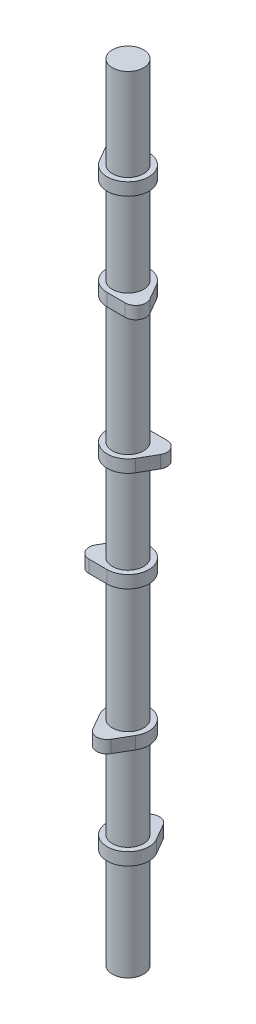
ISO-10303-21;
HEADER;
FILE_DESCRIPTION(('STEP AP214'),'2;1');
FILE_NAME('part.step','',(''),(''),'','','');
FILE_SCHEMA(('AUTOMOTIVE_DESIGN { 1 0 10303 214 1 1 1 1 }'));
ENDSEC;
DATA;
#1=APPLICATION_CONTEXT('core data for automotive mechanical design processes');
#2=APPLICATION_PROTOCOL_DEFINITION('international standard','automotive_design',2000,#1);
#3=PRODUCT_CONTEXT('',#1,'mechanical');
#4=PRODUCT('Part','Part','',(#3));
#5=PRODUCT_RELATED_PRODUCT_CATEGORY('part','',(#4));
#6=PRODUCT_DEFINITION_FORMATION('','',#4);
#7=PRODUCT_DEFINITION_CONTEXT('part definition',#1,'design');
#8=PRODUCT_DEFINITION('design','',#6,#7);
#9=PRODUCT_DEFINITION_SHAPE('','',#8);
#10=(LENGTH_UNIT() NAMED_UNIT(*) SI_UNIT(.MILLI.,.METRE.));
#11=(NAMED_UNIT(*) PLANE_ANGLE_UNIT() SI_UNIT($,.RADIAN.));
#12=(NAMED_UNIT(*) SI_UNIT($,.STERADIAN.) SOLID_ANGLE_UNIT());
#13=UNCERTAINTY_MEASURE_WITH_UNIT(LENGTH_MEASURE(1.E-05),#10,'distance_accuracy_value','');
#14=(GEOMETRIC_REPRESENTATION_CONTEXT(3) GLOBAL_UNCERTAINTY_ASSIGNED_CONTEXT((#13)) GLOBAL_UNIT_ASSIGNED_CONTEXT((#10,
#11,#12)) REPRESENTATION_CONTEXT('',''));
#15=CARTESIAN_POINT('',(0.,0.,0.));
#16=DIRECTION('',(0.,0.,1.));
#17=DIRECTION('',(1.,0.,0.));
#18=AXIS2_PLACEMENT_3D('',#15,#16,#17);
#19=CARTESIAN_POINT('',(10.9985226280624,210.82,-6.34999999999998));
#20=DIRECTION('',(0.,-1.,0.));
#21=DIRECTION('',(0.86602540378444,0.,-0.499999999999998));
#22=AXIS2_PLACEMENT_3D('',#19,#20,#21);
#23=CYLINDRICAL_SURFACE('',#22,6.35);
#24=CARTESIAN_POINT('',(10.9985226280624,203.2,-6.34999999999998));
#25=DIRECTION('',(0.,1.,0.));
#26=DIRECTION('',(-0.86602540378444,0.,0.499999999999998));
#27=AXIS2_PLACEMENT_3D('',#24,#25,#26);
#28=CIRCLE('',#27,6.35);
#29=CARTESIAN_POINT('',(16.4977839420936,203.2,-3.17499999999996));
#30=VERTEX_POINT('',#29);
#31=CARTESIAN_POINT('',(10.9985226280624,203.2,-12.7));
#32=VERTEX_POINT('',#31);
#33=EDGE_CURVE('E393',#30,#32,#28,.T.);
#34=ORIENTED_EDGE('',*,*,#33,.T.);
#35=DIRECTION('',(0.,-1.,0.));
#36=VECTOR('',#35,1.);
#37=CARTESIAN_POINT('',(10.9985226280624,210.82,-12.7));
#38=LINE('',#37,#36);
#39=CARTESIAN_POINT('',(10.9985226280624,210.82,-12.7));
#40=VERTEX_POINT('',#39);
#41=EDGE_CURVE('E385',#40,#32,#38,.T.);
#42=ORIENTED_EDGE('',*,*,#41,.F.);
#43=CARTESIAN_POINT('',(10.9985226280624,210.82,-6.34999999999998));
#44=DIRECTION('',(0.,1.,0.));
#45=DIRECTION('',(-0.86602540378444,0.,0.499999999999998));
#46=AXIS2_PLACEMENT_3D('',#43,#44,#45);
#47=CIRCLE('',#46,6.35);
#48=CARTESIAN_POINT('',(16.4977839420936,210.82,-3.17499999999996));
#49=VERTEX_POINT('',#48);
#50=EDGE_CURVE('E386',#49,#40,#47,.T.);
#51=ORIENTED_EDGE('',*,*,#50,.F.);
#52=DIRECTION('',(0.,-1.,0.));
#53=VECTOR('',#52,1.);
#54=CARTESIAN_POINT('',(16.4977839420936,210.82,-3.17499999999996));
#55=LINE('',#54,#53);
#56=EDGE_CURVE('E392',#49,#30,#55,.T.);
#57=ORIENTED_EDGE('',*,*,#56,.T.);
#58=EDGE_LOOP('',(#34,#42,#51,#57));
#59=FACE_BOUND('',#58,.T.);
#60=ADVANCED_FACE('F34',(#59),#23,.T.);
#61=CARTESIAN_POINT('',(10.9985226280624,210.82,-12.7));
#62=DIRECTION('',(0.,0.,1.));
#63=DIRECTION('',(1.,0.,0.));
#64=AXIS2_PLACEMENT_3D('',#61,#62,#63);
#65=PLANE('',#64);
#66=DIRECTION('',(-1.,0.,0.));
#67=VECTOR('',#66,1.);
#68=CARTESIAN_POINT('',(10.9985226280624,203.2,-12.7));
#69=LINE('',#68,#67);
#70=CARTESIAN_POINT('',(0.,203.2,-12.7));
#71=VERTEX_POINT('',#70);
#72=EDGE_CURVE('E396',#32,#71,#69,.T.);
#73=ORIENTED_EDGE('',*,*,#72,.T.);
#74=DIRECTION('',(0.,-1.,0.));
#75=VECTOR('',#74,1.);
#76=CARTESIAN_POINT('',(0.,210.82,-12.7));
#77=LINE('',#76,#75);
#78=CARTESIAN_POINT('',(0.,210.82,-12.7));
#79=VERTEX_POINT('',#78);
#80=EDGE_CURVE('E404',#79,#71,#77,.T.);
#81=ORIENTED_EDGE('',*,*,#80,.F.);
#82=DIRECTION('',(-1.,0.,0.));
#83=VECTOR('',#82,1.);
#84=CARTESIAN_POINT('',(10.9985226280624,210.82,-12.7));
#85=LINE('',#84,#83);
#86=EDGE_CURVE('E82',#40,#79,#85,.T.);
#87=ORIENTED_EDGE('',*,*,#86,.F.);
#88=ORIENTED_EDGE('',*,*,#41,.T.);
#89=EDGE_LOOP('',(#73,#81,#87,#88));
#90=FACE_BOUND('',#89,.T.);
#91=ADVANCED_FACE('F447',(#90),#65,.F.);
#92=CARTESIAN_POINT('',(0.,210.82,0.));
#93=DIRECTION('',(0.,-1.,0.));
#94=DIRECTION('',(0.86602540378444,0.,-0.499999999999998));
#95=AXIS2_PLACEMENT_3D('',#92,#93,#94);
#96=CYLINDRICAL_SURFACE('',#95,12.7);
#97=CARTESIAN_POINT('',(0.,203.2,0.));
#98=DIRECTION('',(0.,1.,0.));
#99=DIRECTION('',(-0.86602540378444,0.,0.499999999999998));
#100=AXIS2_PLACEMENT_3D('',#97,#98,#99);
#101=CIRCLE('',#100,12.7);
#102=CARTESIAN_POINT('',(10.9985226280624,203.2,6.35000000000002));
#103=VERTEX_POINT('',#102);
#104=EDGE_CURVE('E68',#71,#103,#101,.T.);
#105=ORIENTED_EDGE('',*,*,#104,.T.);
#106=DIRECTION('',(0.,-1.,0.));
#107=VECTOR('',#106,1.);
#108=CARTESIAN_POINT('',(10.9985226280624,210.82,6.35000000000002));
#109=LINE('',#108,#107);
#110=CARTESIAN_POINT('',(10.9985226280624,210.82,6.35000000000002));
#111=VERTEX_POINT('',#110);
#112=EDGE_CURVE('E402',#111,#103,#109,.T.);
#113=ORIENTED_EDGE('',*,*,#112,.F.);
#114=CARTESIAN_POINT('',(0.,210.82,0.));
#115=DIRECTION('',(0.,1.,0.));
#116=DIRECTION('',(-0.86602540378444,0.,0.499999999999998));
#117=AXIS2_PLACEMENT_3D('',#114,#115,#116);
#118=CIRCLE('',#117,12.7);
#119=EDGE_CURVE('E389',#79,#111,#118,.T.);
#120=ORIENTED_EDGE('',*,*,#119,.F.);
#121=ORIENTED_EDGE('',*,*,#80,.T.);
#122=EDGE_LOOP('',(#105,#113,#120,#121));
#123=FACE_BOUND('',#122,.T.);
#124=ADVANCED_FACE('F452',(#123),#96,.T.);
#125=CARTESIAN_POINT('',(16.4977839420936,210.82,-3.17499999999996));
#126=DIRECTION('',(-0.866025403784438,0.,-0.500000000000002));
#127=DIRECTION('',(-0.500000000000002,0.,0.866025403784438));
#128=AXIS2_PLACEMENT_3D('',#125,#126,#127);
#129=PLANE('',#128);
#130=DIRECTION('',(0.500000000000002,0.,-0.866025403784438));
#131=VECTOR('',#130,1.);
#132=CARTESIAN_POINT('',(16.4977839420936,203.2,-3.17499999999996));
#133=LINE('',#132,#131);
#134=EDGE_CURVE('E74',#103,#30,#133,.T.);
#135=ORIENTED_EDGE('',*,*,#134,.T.);
#136=ORIENTED_EDGE('',*,*,#56,.F.);
#137=DIRECTION('',(0.500000000000002,0.,-0.866025403784438));
#138=VECTOR('',#137,1.);
#139=CARTESIAN_POINT('',(16.4977839420936,210.82,-3.17499999999996));
#140=LINE('',#139,#138);
#141=EDGE_CURVE('E50',#111,#49,#140,.T.);
#142=ORIENTED_EDGE('',*,*,#141,.F.);
#143=ORIENTED_EDGE('',*,*,#112,.T.);
#144=EDGE_LOOP('',(#135,#136,#142,#143));
#145=FACE_BOUND('',#144,.T.);
#146=ADVANCED_FACE('F461',(#145),#129,.F.);
#147=CARTESIAN_POINT('',(10.9985226280624,210.82,-6.34999999999998));
#148=DIRECTION('',(0.,1.,0.));
#149=DIRECTION('',(-0.86602540378444,0.,0.499999999999998));
#150=AXIS2_PLACEMENT_3D('',#147,#148,#149);
#151=PLANE('',#150);
#152=CARTESIAN_POINT('',(0.,210.82,0.));
#153=DIRECTION('',(0.,1.,0.));
#154=DIRECTION('',(0.866025403784436,0.,-0.500000000000004));
#155=AXIS2_PLACEMENT_3D('',#152,#153,#154);
#156=CIRCLE('',#155,9.5);
#157=CARTESIAN_POINT('',(8.22724133595215,210.82,-4.75000000000004));
#158=VERTEX_POINT('',#157);
#159=EDGE_CURVE('E42',#158,#158,#156,.T.);
#160=ORIENTED_EDGE('',*,*,#159,.F.);
#161=EDGE_LOOP('',(#160));
#162=FACE_BOUND('',#161,.T.);
#163=ORIENTED_EDGE('',*,*,#50,.T.);
#164=ORIENTED_EDGE('',*,*,#86,.T.);
#165=ORIENTED_EDGE('',*,*,#119,.T.);
#166=ORIENTED_EDGE('',*,*,#141,.T.);
#167=EDGE_LOOP('',(#163,#164,#165,#166));
#168=FACE_BOUND('',#167,.T.);
#169=ADVANCED_FACE('F459',(#162,#168),#151,.T.);
#170=CARTESIAN_POINT('',(10.9985226280624,203.2,-6.34999999999998));
#171=DIRECTION('',(0.,1.,0.));
#172=DIRECTION('',(-0.86602540378444,0.,0.499999999999998));
#173=AXIS2_PLACEMENT_3D('',#170,#171,#172);
#174=PLANE('',#173);
#175=CARTESIAN_POINT('',(0.,203.2,0.));
#176=DIRECTION('',(0.,1.,0.));
#177=DIRECTION('',(0.866025403784436,0.,-0.500000000000004));
#178=AXIS2_PLACEMENT_3D('',#175,#176,#177);
#179=CIRCLE('',#178,9.5);
#180=CARTESIAN_POINT('',(8.22724133595215,203.2,-4.75000000000004));
#181=VERTEX_POINT('',#180);
#182=EDGE_CURVE('E397',#181,#181,#179,.T.);
#183=ORIENTED_EDGE('',*,*,#182,.T.);
#184=EDGE_LOOP('',(#183));
#185=FACE_BOUND('',#184,.T.);
#186=ORIENTED_EDGE('',*,*,#33,.F.);
#187=ORIENTED_EDGE('',*,*,#134,.F.);
#188=ORIENTED_EDGE('',*,*,#104,.F.);
#189=ORIENTED_EDGE('',*,*,#72,.F.);
#190=EDGE_LOOP('',(#186,#187,#188,#189));
#191=FACE_BOUND('',#190,.T.);
#192=ADVANCED_FACE('F457',(#185,#191),#174,.F.);
#193=CARTESIAN_POINT('',(0.,108.95,0.));
#194=DIRECTION('',(0.,1.,0.));
#195=DIRECTION('',(0.866025403784436,0.,-0.500000000000004));
#196=AXIS2_PLACEMENT_3D('',#193,#194,#195);
#197=CYLINDRICAL_SURFACE('',#196,9.5);
#198=CARTESIAN_POINT('',(0.,149.86,0.));
#199=DIRECTION('',(0.,1.,0.));
#200=DIRECTION('',(0.866025403784436,0.,-0.500000000000004));
#201=AXIS2_PLACEMENT_3D('',#198,#199,#200);
#202=CIRCLE('',#201,9.5);
#203=CARTESIAN_POINT('',(8.22724133595215,149.86,-4.75000000000004));
#204=VERTEX_POINT('',#203);
#205=EDGE_CURVE('E11',#204,#204,#202,.F.);
#206=ORIENTED_EDGE('',*,*,#205,.F.);
#207=EDGE_LOOP('',(#206));
#208=FACE_BOUND('',#207,.T.);
#209=ORIENTED_EDGE('',*,*,#182,.F.);
#210=EDGE_LOOP('',(#209));
#211=FACE_BOUND('',#210,.T.);
#212=ADVANCED_FACE('F468',(#208,#211),#197,.T.);
#213=CARTESIAN_POINT('',(0.,288.29,0.));
#214=DIRECTION('',(0.,1.,0.));
#215=DIRECTION('',(-0.866025403784443,0.,-0.499999999999992));
#216=AXIS2_PLACEMENT_3D('',#213,#214,#215);
#217=CIRCLE('',#216,9.5);
#218=CARTESIAN_POINT('',(-8.22724133595221,288.29,-4.74999999999992));
#219=VERTEX_POINT('',#218);
#220=EDGE_CURVE('E307',#219,#219,#217,.F.);
#221=ORIENTED_EDGE('',*,*,#220,.T.);
#222=EDGE_LOOP('',(#221));
#223=FACE_BOUND('',#222,.T.);
#224=ORIENTED_EDGE('',*,*,#159,.T.);
#225=EDGE_LOOP('',(#224));
#226=FACE_BOUND('',#225,.T.);
#227=ADVANCED_FACE('F474',(#223,#226),#197,.T.);
#228=CARTESIAN_POINT('',(-10.9985226280623,149.86,6.35000000000005));
#229=DIRECTION('',(0.,-1.,0.));
#230=DIRECTION('',(-0.866025403784436,0.,0.500000000000004));
#231=AXIS2_PLACEMENT_3D('',#228,#229,#230);
#232=CYLINDRICAL_SURFACE('',#231,6.35);
#233=CARTESIAN_POINT('',(-10.9985226280623,142.24,6.35000000000005));
#234=DIRECTION('',(0.,1.,0.));
#235=DIRECTION('',(0.866025403784436,0.,-0.500000000000004));
#236=AXIS2_PLACEMENT_3D('',#233,#234,#235);
#237=CIRCLE('',#236,6.35);
#238=CARTESIAN_POINT('',(-16.4977839420935,142.24,3.17500000000008));
#239=VERTEX_POINT('',#238);
#240=CARTESIAN_POINT('',(-10.9985226280623,142.24,12.7000000000001));
#241=VERTEX_POINT('',#240);
#242=EDGE_CURVE('E352',#239,#241,#237,.T.);
#243=ORIENTED_EDGE('',*,*,#242,.T.);
#244=DIRECTION('',(0.,-1.,0.));
#245=VECTOR('',#244,1.);
#246=CARTESIAN_POINT('',(-10.9985226280623,149.86,12.7000000000001));
#247=LINE('',#246,#245);
#248=CARTESIAN_POINT('',(-10.9985226280623,149.86,12.7000000000001));
#249=VERTEX_POINT('',#248);
#250=EDGE_CURVE('E379',#249,#241,#247,.T.);
#251=ORIENTED_EDGE('',*,*,#250,.F.);
#252=CARTESIAN_POINT('',(-10.9985226280623,149.86,6.35000000000005));
#253=DIRECTION('',(0.,1.,0.));
#254=DIRECTION('',(0.866025403784436,0.,-0.500000000000004));
#255=AXIS2_PLACEMENT_3D('',#252,#253,#254);
#256=CIRCLE('',#255,6.35);
#257=CARTESIAN_POINT('',(-16.4977839420935,149.86,3.17500000000008));
#258=VERTEX_POINT('',#257);
#259=EDGE_CURVE('E353',#258,#249,#256,.T.);
#260=ORIENTED_EDGE('',*,*,#259,.F.);
#261=DIRECTION('',(0.,-1.,0.));
#262=VECTOR('',#261,1.);
#263=CARTESIAN_POINT('',(-16.4977839420935,149.86,3.17500000000008));
#264=LINE('',#263,#262);
#265=EDGE_CURVE('E363',#258,#239,#264,.T.);
#266=ORIENTED_EDGE('',*,*,#265,.T.);
#267=EDGE_LOOP('',(#243,#251,#260,#266));
#268=FACE_BOUND('',#267,.T.);
#269=ADVANCED_FACE('F424',(#268),#232,.T.);
#270=CARTESIAN_POINT('',(-10.9985226280623,149.86,12.7000000000001));
#271=DIRECTION('',(0.,0.,-1.));
#272=DIRECTION('',(-1.,0.,0.));
#273=AXIS2_PLACEMENT_3D('',#270,#271,#272);
#274=PLANE('',#273);
#275=DIRECTION('',(1.,0.,0.));
#276=VECTOR('',#275,1.);
#277=CARTESIAN_POINT('',(-10.9985226280623,142.24,12.7000000000001));
#278=LINE('',#277,#276);
#279=CARTESIAN_POINT('',(0.,142.24,12.7));
#280=VERTEX_POINT('',#279);
#281=EDGE_CURVE('E366',#241,#280,#278,.T.);
#282=ORIENTED_EDGE('',*,*,#281,.T.);
#283=DIRECTION('',(0.,-1.,0.));
#284=VECTOR('',#283,1.);
#285=CARTESIAN_POINT('',(0.,149.86,12.7));
#286=LINE('',#285,#284);
#287=CARTESIAN_POINT('',(0.,149.86,12.7));
#288=VERTEX_POINT('',#287);
#289=EDGE_CURVE('E376',#288,#280,#286,.T.);
#290=ORIENTED_EDGE('',*,*,#289,.F.);
#291=DIRECTION('',(1.,0.,0.));
#292=VECTOR('',#291,1.);
#293=CARTESIAN_POINT('',(-10.9985226280623,149.86,12.7000000000001));
#294=LINE('',#293,#292);
#295=EDGE_CURVE('E356',#249,#288,#294,.T.);
#296=ORIENTED_EDGE('',*,*,#295,.F.);
#297=ORIENTED_EDGE('',*,*,#250,.T.);
#298=EDGE_LOOP('',(#282,#290,#296,#297));
#299=FACE_BOUND('',#298,.T.);
#300=ADVANCED_FACE('F436',(#299),#274,.F.);
#301=CARTESIAN_POINT('',(0.,149.86,0.));
#302=DIRECTION('',(0.,-1.,0.));
#303=DIRECTION('',(-0.866025403784436,0.,0.500000000000004));
#304=AXIS2_PLACEMENT_3D('',#301,#302,#303);
#305=CYLINDRICAL_SURFACE('',#304,12.7);
#306=CARTESIAN_POINT('',(0.,142.24,0.));
#307=DIRECTION('',(0.,1.,0.));
#308=DIRECTION('',(0.866025403784436,0.,-0.500000000000004));
#309=AXIS2_PLACEMENT_3D('',#306,#307,#308);
#310=CIRCLE('',#309,12.7);
#311=CARTESIAN_POINT('',(-10.9985226280624,142.24,-6.34999999999994));
#312=VERTEX_POINT('',#311);
#313=EDGE_CURVE('E368',#280,#312,#310,.T.);
#314=ORIENTED_EDGE('',*,*,#313,.T.);
#315=DIRECTION('',(0.,-1.,0.));
#316=VECTOR('',#315,1.);
#317=CARTESIAN_POINT('',(-10.9985226280624,149.86,-6.34999999999994));
#318=LINE('',#317,#316);
#319=CARTESIAN_POINT('',(-10.9985226280624,149.86,-6.34999999999994));
#320=VERTEX_POINT('',#319);
#321=EDGE_CURVE('E373',#320,#312,#318,.T.);
#322=ORIENTED_EDGE('',*,*,#321,.F.);
#323=CARTESIAN_POINT('',(0.,149.86,0.));
#324=DIRECTION('',(0.,1.,0.));
#325=DIRECTION('',(0.866025403784436,0.,-0.500000000000004));
#326=AXIS2_PLACEMENT_3D('',#323,#324,#325);
#327=CIRCLE('',#326,12.7);
#328=EDGE_CURVE('E359',#288,#320,#327,.T.);
#329=ORIENTED_EDGE('',*,*,#328,.F.);
#330=ORIENTED_EDGE('',*,*,#289,.T.);
#331=EDGE_LOOP('',(#314,#322,#329,#330));
#332=FACE_BOUND('',#331,.T.);
#333=ADVANCED_FACE('F433',(#332),#305,.T.);
#334=CARTESIAN_POINT('',(-16.4977839420935,149.86,3.17500000000008));
#335=DIRECTION('',(0.866025403784441,0.,0.499999999999996));
#336=DIRECTION('',(0.499999999999996,0.,-0.866025403784441));
#337=AXIS2_PLACEMENT_3D('',#334,#335,#336);
#338=PLANE('',#337);
#339=DIRECTION('',(-0.499999999999996,0.,0.866025403784441));
#340=VECTOR('',#339,1.);
#341=CARTESIAN_POINT('',(-16.4977839420935,142.24,3.17500000000008));
#342=LINE('',#341,#340);
#343=EDGE_CURVE('E357',#312,#239,#342,.T.);
#344=ORIENTED_EDGE('',*,*,#343,.T.);
#345=ORIENTED_EDGE('',*,*,#265,.F.);
#346=DIRECTION('',(-0.499999999999996,0.,0.866025403784441));
#347=VECTOR('',#346,1.);
#348=CARTESIAN_POINT('',(-16.4977839420935,149.86,3.17500000000008));
#349=LINE('',#348,#347);
#350=EDGE_CURVE('E361',#320,#258,#349,.T.);
#351=ORIENTED_EDGE('',*,*,#350,.F.);
#352=ORIENTED_EDGE('',*,*,#321,.T.);
#353=EDGE_LOOP('',(#344,#345,#351,#352));
#354=FACE_BOUND('',#353,.T.);
#355=ADVANCED_FACE('F429',(#354),#338,.F.);
#356=CARTESIAN_POINT('',(-10.9985226280623,149.86,6.35000000000005));
#357=DIRECTION('',(0.,1.,0.));
#358=DIRECTION('',(0.866025403784436,0.,-0.500000000000004));
#359=AXIS2_PLACEMENT_3D('',#356,#357,#358);
#360=PLANE('',#359);
#361=ORIENTED_EDGE('',*,*,#205,.T.);
#362=EDGE_LOOP('',(#361));
#363=FACE_BOUND('',#362,.T.);
#364=ORIENTED_EDGE('',*,*,#259,.T.);
#365=ORIENTED_EDGE('',*,*,#295,.T.);
#366=ORIENTED_EDGE('',*,*,#328,.T.);
#367=ORIENTED_EDGE('',*,*,#350,.T.);
#368=EDGE_LOOP('',(#364,#365,#366,#367));
#369=FACE_BOUND('',#368,.T.);
#370=ADVANCED_FACE('F417',(#363,#369),#360,.T.);
#371=CARTESIAN_POINT('',(-10.9985226280623,142.24,6.35000000000005));
#372=DIRECTION('',(0.,1.,0.));
#373=DIRECTION('',(0.866025403784436,0.,-0.500000000000004));
#374=AXIS2_PLACEMENT_3D('',#371,#372,#373);
#375=PLANE('',#374);
#376=CARTESIAN_POINT('',(0.,142.24,0.));
#377=DIRECTION('',(0.,1.,0.));
#378=DIRECTION('',(0.866025403784436,0.,-0.500000000000004));
#379=AXIS2_PLACEMENT_3D('',#376,#377,#378);
#380=CIRCLE('',#379,9.5);
#381=CARTESIAN_POINT('',(8.22724133595215,142.24,-4.75000000000004));
#382=VERTEX_POINT('',#381);
#383=EDGE_CURVE('E382',#382,#382,#380,.F.);
#384=ORIENTED_EDGE('',*,*,#383,.F.);
#385=EDGE_LOOP('',(#384));
#386=FACE_BOUND('',#385,.T.);
#387=ORIENTED_EDGE('',*,*,#242,.F.);
#388=ORIENTED_EDGE('',*,*,#343,.F.);
#389=ORIENTED_EDGE('',*,*,#313,.F.);
#390=ORIENTED_EDGE('',*,*,#281,.F.);
#391=EDGE_LOOP('',(#387,#388,#389,#390));
#392=FACE_BOUND('',#391,.T.);
#393=ADVANCED_FACE('F414',(#386,#392),#375,.F.);
#394=ORIENTED_EDGE('',*,*,#383,.T.);
#395=EDGE_LOOP('',(#394));
#396=FACE_BOUND('',#395,.T.);
#397=CARTESIAN_POINT('',(0.,64.77,0.));
#398=DIRECTION('',(0.,1.,0.));
#399=DIRECTION('',(0.,0.,1.));
#400=AXIS2_PLACEMENT_3D('',#397,#398,#399);
#401=CIRCLE('',#400,9.5);
#402=CARTESIAN_POINT('',(0.,64.77,9.5));
#403=VERTEX_POINT('',#402);
#404=EDGE_CURVE('E239',#403,#403,#401,.T.);
#405=ORIENTED_EDGE('',*,*,#404,.T.);
#406=EDGE_LOOP('',(#405));
#407=FACE_BOUND('',#406,.T.);
#408=ADVANCED_FACE('F411',(#396,#407),#197,.T.);
#409=CARTESIAN_POINT('',(-10.9985226280624,356.87,-6.34999999999998));
#410=DIRECTION('',(0.,-1.,0.));
#411=DIRECTION('',(-0.86602540378444,0.,-0.499999999999998));
#412=AXIS2_PLACEMENT_3D('',#409,#410,#411);
#413=CYLINDRICAL_SURFACE('',#412,6.35);
#414=CARTESIAN_POINT('',(-10.9985226280624,349.25,-6.34999999999998));
#415=DIRECTION('',(0.,1.,0.));
#416=DIRECTION('',(0.86602540378444,0.,0.499999999999998));
#417=AXIS2_PLACEMENT_3D('',#414,#415,#416);
#418=CIRCLE('',#417,6.35);
#419=CARTESIAN_POINT('',(-10.9985226280624,349.25,-12.7));
#420=VERTEX_POINT('',#419);
#421=CARTESIAN_POINT('',(-16.4977839420936,349.25,-3.17499999999996));
#422=VERTEX_POINT('',#421);
#423=EDGE_CURVE('E328',#420,#422,#418,.T.);
#424=ORIENTED_EDGE('',*,*,#423,.T.);
#425=DIRECTION('',(0.,-1.,0.));
#426=VECTOR('',#425,1.);
#427=CARTESIAN_POINT('',(-16.4977839420936,356.87,-3.17499999999996));
#428=LINE('',#427,#426);
#429=CARTESIAN_POINT('',(-16.4977839420936,356.87,-3.17499999999996));
#430=VERTEX_POINT('',#429);
#431=EDGE_CURVE('E316',#430,#422,#428,.T.);
#432=ORIENTED_EDGE('',*,*,#431,.F.);
#433=CARTESIAN_POINT('',(-10.9985226280624,356.87,-6.34999999999998));
#434=DIRECTION('',(0.,1.,0.));
#435=DIRECTION('',(0.86602540378444,0.,0.499999999999998));
#436=AXIS2_PLACEMENT_3D('',#433,#434,#435);
#437=CIRCLE('',#436,6.35);
#438=CARTESIAN_POINT('',(-10.9985226280624,356.87,-12.7));
#439=VERTEX_POINT('',#438);
#440=EDGE_CURVE('E317',#439,#430,#437,.T.);
#441=ORIENTED_EDGE('',*,*,#440,.F.);
#442=DIRECTION('',(0.,-1.,0.));
#443=VECTOR('',#442,1.);
#444=CARTESIAN_POINT('',(-10.9985226280624,356.87,-12.7));
#445=LINE('',#444,#443);
#446=EDGE_CURVE('E327',#439,#420,#445,.T.);
#447=ORIENTED_EDGE('',*,*,#446,.T.);
#448=EDGE_LOOP('',(#424,#432,#441,#447));
#449=FACE_BOUND('',#448,.T.);
#450=ADVANCED_FACE('F511',(#449),#413,.T.);
#451=CARTESIAN_POINT('',(-16.4977839420936,356.87,-3.17499999999996));
#452=DIRECTION('',(0.866025403784438,0.,-0.500000000000002));
#453=DIRECTION('',(-0.500000000000002,0.,-0.866025403784438));
#454=AXIS2_PLACEMENT_3D('',#451,#452,#453);
#455=PLANE('',#454);
#456=DIRECTION('',(0.500000000000002,0.,0.866025403784438));
#457=VECTOR('',#456,1.);
#458=CARTESIAN_POINT('',(-16.4977839420936,349.25,-3.17499999999996));
#459=LINE('',#458,#457);
#460=CARTESIAN_POINT('',(-10.9985226280624,349.25,6.35000000000002));
#461=VERTEX_POINT('',#460);
#462=EDGE_CURVE('E331',#422,#461,#459,.T.);
#463=ORIENTED_EDGE('',*,*,#462,.T.);
#464=DIRECTION('',(0.,-1.,0.));
#465=VECTOR('',#464,1.);
#466=CARTESIAN_POINT('',(-10.9985226280624,356.87,6.35000000000002));
#467=LINE('',#466,#465);
#468=CARTESIAN_POINT('',(-10.9985226280624,356.87,6.35000000000002));
#469=VERTEX_POINT('',#468);
#470=EDGE_CURVE('E341',#469,#461,#467,.T.);
#471=ORIENTED_EDGE('',*,*,#470,.F.);
#472=DIRECTION('',(0.500000000000002,0.,0.866025403784438));
#473=VECTOR('',#472,1.);
#474=CARTESIAN_POINT('',(-16.4977839420936,356.87,-3.17499999999996));
#475=LINE('',#474,#473);
#476=EDGE_CURVE('E320',#430,#469,#475,.T.);
#477=ORIENTED_EDGE('',*,*,#476,.F.);
#478=ORIENTED_EDGE('',*,*,#431,.T.);
#479=EDGE_LOOP('',(#463,#471,#477,#478));
#480=FACE_BOUND('',#479,.T.);
#481=ADVANCED_FACE('F584',(#480),#455,.F.);
#482=CARTESIAN_POINT('',(0.,356.87,0.));
#483=DIRECTION('',(0.,-1.,0.));
#484=DIRECTION('',(-0.86602540378444,0.,-0.499999999999998));
#485=AXIS2_PLACEMENT_3D('',#482,#483,#484);
#486=CYLINDRICAL_SURFACE('',#485,12.7);
#487=CARTESIAN_POINT('',(0.,349.25,0.));
#488=DIRECTION('',(0.,1.,0.));
#489=DIRECTION('',(0.86602540378444,0.,0.499999999999998));
#490=AXIS2_PLACEMENT_3D('',#487,#488,#489);
#491=CIRCLE('',#490,12.7);
#492=CARTESIAN_POINT('',(0.,349.25,-12.7));
#493=VERTEX_POINT('',#492);
#494=EDGE_CURVE('E333',#461,#493,#491,.T.);
#495=ORIENTED_EDGE('',*,*,#494,.T.);
#496=DIRECTION('',(0.,-1.,0.));
#497=VECTOR('',#496,1.);
#498=CARTESIAN_POINT('',(0.,356.87,-12.7));
#499=LINE('',#498,#497);
#500=CARTESIAN_POINT('',(0.,356.87,-12.7));
#501=VERTEX_POINT('',#500);
#502=EDGE_CURVE('E338',#501,#493,#499,.T.);
#503=ORIENTED_EDGE('',*,*,#502,.F.);
#504=CARTESIAN_POINT('',(0.,356.87,0.));
#505=DIRECTION('',(0.,1.,0.));
#506=DIRECTION('',(0.86602540378444,0.,0.499999999999998));
#507=AXIS2_PLACEMENT_3D('',#504,#505,#506);
#508=CIRCLE('',#507,12.7);
#509=EDGE_CURVE('E323',#469,#501,#508,.T.);
#510=ORIENTED_EDGE('',*,*,#509,.F.);
#511=ORIENTED_EDGE('',*,*,#470,.T.);
#512=EDGE_LOOP('',(#495,#503,#510,#511));
#513=FACE_BOUND('',#512,.T.);
#514=ADVANCED_FACE('F593',(#513),#486,.T.);
#515=CARTESIAN_POINT('',(-10.9985226280624,356.87,-12.7));
#516=DIRECTION('',(0.,0.,1.));
#517=DIRECTION('',(1.,0.,0.));
#518=AXIS2_PLACEMENT_3D('',#515,#516,#517);
#519=PLANE('',#518);
#520=DIRECTION('',(-1.,0.,0.));
#521=VECTOR('',#520,1.);
#522=CARTESIAN_POINT('',(-10.9985226280624,349.25,-12.7));
#523=LINE('',#522,#521);
#524=EDGE_CURVE('E321',#493,#420,#523,.T.);
#525=ORIENTED_EDGE('',*,*,#524,.T.);
#526=ORIENTED_EDGE('',*,*,#446,.F.);
#527=DIRECTION('',(-1.,0.,0.));
#528=VECTOR('',#527,1.);
#529=CARTESIAN_POINT('',(-10.9985226280624,356.87,-12.7));
#530=LINE('',#529,#528);
#531=EDGE_CURVE('E325',#501,#439,#530,.T.);
#532=ORIENTED_EDGE('',*,*,#531,.F.);
#533=ORIENTED_EDGE('',*,*,#502,.T.);
#534=EDGE_LOOP('',(#525,#526,#532,#533));
#535=FACE_BOUND('',#534,.T.);
#536=ADVANCED_FACE('F603',(#535),#519,.F.);
#537=CARTESIAN_POINT('',(-10.9985226280624,356.87,-6.34999999999998));
#538=DIRECTION('',(0.,1.,0.));
#539=DIRECTION('',(0.86602540378444,0.,0.499999999999998));
#540=AXIS2_PLACEMENT_3D('',#537,#538,#539);
#541=PLANE('',#540);
#542=CARTESIAN_POINT('',(0.,356.87,0.));
#543=DIRECTION('',(0.,1.,0.));
#544=DIRECTION('',(-0.866025403784443,0.,-0.499999999999992));
#545=AXIS2_PLACEMENT_3D('',#542,#543,#544);
#546=CIRCLE('',#545,9.5);
#547=CARTESIAN_POINT('',(-8.22724133595221,356.87,-4.74999999999992));
#548=VERTEX_POINT('',#547);
#549=EDGE_CURVE('E312',#548,#548,#546,.T.);
#550=ORIENTED_EDGE('',*,*,#549,.F.);
#551=EDGE_LOOP('',(#550));
#552=FACE_BOUND('',#551,.T.);
#553=ORIENTED_EDGE('',*,*,#440,.T.);
#554=ORIENTED_EDGE('',*,*,#476,.T.);
#555=ORIENTED_EDGE('',*,*,#509,.T.);
#556=ORIENTED_EDGE('',*,*,#531,.T.);
#557=EDGE_LOOP('',(#553,#554,#555,#556));
#558=FACE_BOUND('',#557,.T.);
#559=ADVANCED_FACE('F613',(#552,#558),#541,.T.);
#560=CARTESIAN_POINT('',(-10.9985226280624,349.25,-6.34999999999998));
#561=DIRECTION('',(0.,1.,0.));
#562=DIRECTION('',(0.86602540378444,0.,0.499999999999998));
#563=AXIS2_PLACEMENT_3D('',#560,#561,#562);
#564=PLANE('',#563);
#565=CARTESIAN_POINT('',(0.,349.25,0.));
#566=DIRECTION('',(0.,1.,0.));
#567=DIRECTION('',(-0.866025403784443,0.,-0.499999999999992));
#568=AXIS2_PLACEMENT_3D('',#565,#566,#567);
#569=CIRCLE('',#568,9.5);
#570=CARTESIAN_POINT('',(-8.22724133595221,349.25,-4.74999999999992));
#571=VERTEX_POINT('',#570);
#572=EDGE_CURVE('E311',#571,#571,#569,.T.);
#573=ORIENTED_EDGE('',*,*,#572,.T.);
#574=EDGE_LOOP('',(#573));
#575=FACE_BOUND('',#574,.T.);
#576=ORIENTED_EDGE('',*,*,#423,.F.);
#577=ORIENTED_EDGE('',*,*,#524,.F.);
#578=ORIENTED_EDGE('',*,*,#494,.F.);
#579=ORIENTED_EDGE('',*,*,#462,.F.);
#580=EDGE_LOOP('',(#576,#577,#578,#579));
#581=FACE_BOUND('',#580,.T.);
#582=ADVANCED_FACE('F623',(#575,#581),#564,.F.);
#583=CARTESIAN_POINT('',(0.,255.,0.));
#584=DIRECTION('',(0.,1.,0.));
#585=DIRECTION('',(-0.866025403784443,0.,-0.499999999999992));
#586=AXIS2_PLACEMENT_3D('',#583,#584,#585);
#587=CYLINDRICAL_SURFACE('',#586,9.5);
#588=CARTESIAN_POINT('',(0.,295.91,0.));
#589=DIRECTION('',(0.,1.,0.));
#590=DIRECTION('',(-0.866025403784443,0.,-0.499999999999992));
#591=AXIS2_PLACEMENT_3D('',#588,#589,#590);
#592=CIRCLE('',#591,9.5);
#593=CARTESIAN_POINT('',(-8.22724133595221,295.91,-4.74999999999992));
#594=VERTEX_POINT('',#593);
#595=EDGE_CURVE('E315',#594,#594,#592,.F.);
#596=ORIENTED_EDGE('',*,*,#595,.F.);
#597=EDGE_LOOP('',(#596));
#598=FACE_BOUND('',#597,.T.);
#599=ORIENTED_EDGE('',*,*,#572,.F.);
#600=EDGE_LOOP('',(#599));
#601=FACE_BOUND('',#600,.T.);
#602=ADVANCED_FACE('F633',(#598,#601),#587,.T.);
#603=ORIENTED_EDGE('',*,*,#549,.T.);
#604=EDGE_LOOP('',(#603));
#605=FACE_BOUND('',#604,.T.);
#606=CARTESIAN_POINT('',(0.,412.75,0.));
#607=DIRECTION('',(0.,1.,0.));
#608=DIRECTION('',(-0.866025403784443,0.,-0.499999999999992));
#609=AXIS2_PLACEMENT_3D('',#606,#607,#608);
#610=CIRCLE('',#609,9.5);
#611=CARTESIAN_POINT('',(-8.22724133595221,412.75,-4.74999999999992));
#612=VERTEX_POINT('',#611);
#613=EDGE_CURVE('E308',#612,#612,#610,.T.);
#614=ORIENTED_EDGE('',*,*,#613,.F.);
#615=EDGE_LOOP('',(#614));
#616=FACE_BOUND('',#615,.T.);
#617=ADVANCED_FACE('F643',(#605,#616),#587,.T.);
#618=CARTESIAN_POINT('',(0.,412.75,0.));
#619=DIRECTION('',(0.,1.,0.));
#620=DIRECTION('',(-0.866025403784443,0.,-0.499999999999992));
#621=AXIS2_PLACEMENT_3D('',#618,#619,#620);
#622=PLANE('',#621);
#623=ORIENTED_EDGE('',*,*,#613,.T.);
#624=EDGE_LOOP('',(#623));
#625=FACE_BOUND('',#624,.T.);
#626=ADVANCED_FACE('F653',(#625),#622,.T.);
#627=CARTESIAN_POINT('',(10.9985226280624,295.91,6.3499999999999));
#628=DIRECTION('',(0.,-1.,0.));
#629=DIRECTION('',(0.866025403784443,0.,0.499999999999992));
#630=AXIS2_PLACEMENT_3D('',#627,#628,#629);
#631=CYLINDRICAL_SURFACE('',#630,6.35);
#632=CARTESIAN_POINT('',(10.9985226280624,288.29,6.3499999999999));
#633=DIRECTION('',(0.,1.,0.));
#634=DIRECTION('',(-0.866025403784443,0.,-0.499999999999992));
#635=AXIS2_PLACEMENT_3D('',#632,#633,#634);
#636=CIRCLE('',#635,6.35);
#637=CARTESIAN_POINT('',(10.9985226280625,288.29,12.6999999999999));
#638=VERTEX_POINT('',#637);
#639=CARTESIAN_POINT('',(16.4977839420936,288.29,3.17499999999985));
#640=VERTEX_POINT('',#639);
#641=EDGE_CURVE('E277',#638,#640,#636,.T.);
#642=ORIENTED_EDGE('',*,*,#641,.T.);
#643=DIRECTION('',(0.,-1.,0.));
#644=VECTOR('',#643,1.);
#645=CARTESIAN_POINT('',(16.4977839420936,295.91,3.17499999999985));
#646=LINE('',#645,#644);
#647=CARTESIAN_POINT('',(16.4977839420936,295.91,3.17499999999985));
#648=VERTEX_POINT('',#647);
#649=EDGE_CURVE('E304',#648,#640,#646,.T.);
#650=ORIENTED_EDGE('',*,*,#649,.F.);
#651=CARTESIAN_POINT('',(10.9985226280624,295.91,6.3499999999999));
#652=DIRECTION('',(0.,1.,0.));
#653=DIRECTION('',(-0.866025403784443,0.,-0.499999999999992));
#654=AXIS2_PLACEMENT_3D('',#651,#652,#653);
#655=CIRCLE('',#654,6.35);
#656=CARTESIAN_POINT('',(10.9985226280625,295.91,12.6999999999999));
#657=VERTEX_POINT('',#656);
#658=EDGE_CURVE('E278',#657,#648,#655,.T.);
#659=ORIENTED_EDGE('',*,*,#658,.F.);
#660=DIRECTION('',(0.,-1.,0.));
#661=VECTOR('',#660,1.);
#662=CARTESIAN_POINT('',(10.9985226280625,295.91,12.6999999999999));
#663=LINE('',#662,#661);
#664=EDGE_CURVE('E288',#657,#638,#663,.T.);
#665=ORIENTED_EDGE('',*,*,#664,.T.);
#666=EDGE_LOOP('',(#642,#650,#659,#665));
#667=FACE_BOUND('',#666,.T.);
#668=ADVANCED_FACE('F662',(#667),#631,.T.);
#669=CARTESIAN_POINT('',(16.4977839420936,295.91,3.17499999999985));
#670=DIRECTION('',(-0.866025403784434,0.,0.500000000000008));
#671=DIRECTION('',(0.500000000000008,0.,0.866025403784434));
#672=AXIS2_PLACEMENT_3D('',#669,#670,#671);
#673=PLANE('',#672);
#674=DIRECTION('',(-0.500000000000008,0.,-0.866025403784434));
#675=VECTOR('',#674,1.);
#676=CARTESIAN_POINT('',(16.4977839420936,288.29,3.17499999999985));
#677=LINE('',#676,#675);
#678=CARTESIAN_POINT('',(10.9985226280623,288.29,-6.3500000000001));
#679=VERTEX_POINT('',#678);
#680=EDGE_CURVE('E291',#640,#679,#677,.T.);
#681=ORIENTED_EDGE('',*,*,#680,.T.);
#682=DIRECTION('',(0.,-1.,0.));
#683=VECTOR('',#682,1.);
#684=CARTESIAN_POINT('',(10.9985226280623,295.91,-6.3500000000001));
#685=LINE('',#684,#683);
#686=CARTESIAN_POINT('',(10.9985226280623,295.91,-6.3500000000001));
#687=VERTEX_POINT('',#686);
#688=EDGE_CURVE('E301',#687,#679,#685,.T.);
#689=ORIENTED_EDGE('',*,*,#688,.F.);
#690=DIRECTION('',(-0.500000000000008,0.,-0.866025403784434));
#691=VECTOR('',#690,1.);
#692=CARTESIAN_POINT('',(16.4977839420936,295.91,3.17499999999985));
#693=LINE('',#692,#691);
#694=EDGE_CURVE('E281',#648,#687,#693,.T.);
#695=ORIENTED_EDGE('',*,*,#694,.F.);
#696=ORIENTED_EDGE('',*,*,#649,.T.);
#697=EDGE_LOOP('',(#681,#689,#695,#696));
#698=FACE_BOUND('',#697,.T.);
#699=ADVANCED_FACE('F672',(#698),#673,.F.);
#700=CARTESIAN_POINT('',(0.,295.91,0.));
#701=DIRECTION('',(0.,-1.,0.));
#702=DIRECTION('',(0.866025403784443,0.,0.499999999999992));
#703=AXIS2_PLACEMENT_3D('',#700,#701,#702);
#704=CYLINDRICAL_SURFACE('',#703,12.7);
#705=CARTESIAN_POINT('',(0.,288.29,0.));
#706=DIRECTION('',(0.,1.,0.));
#707=DIRECTION('',(-0.866025403784443,0.,-0.499999999999992));
#708=AXIS2_PLACEMENT_3D('',#705,#706,#707);
#709=CIRCLE('',#708,12.7);
#710=CARTESIAN_POINT('',(1.32706345912226E-13,288.29,12.7));
#711=VERTEX_POINT('',#710);
#712=EDGE_CURVE('E293',#679,#711,#709,.T.);
#713=ORIENTED_EDGE('',*,*,#712,.T.);
#714=DIRECTION('',(0.,-1.,0.));
#715=VECTOR('',#714,1.);
#716=CARTESIAN_POINT('',(1.32706345912226E-13,295.91,12.7));
#717=LINE('',#716,#715);
#718=CARTESIAN_POINT('',(1.32706345912226E-13,295.91,12.7));
#719=VERTEX_POINT('',#718);
#720=EDGE_CURVE('E298',#719,#711,#717,.T.);
#721=ORIENTED_EDGE('',*,*,#720,.F.);
#722=CARTESIAN_POINT('',(0.,295.91,0.));
#723=DIRECTION('',(0.,1.,0.));
#724=DIRECTION('',(-0.866025403784443,0.,-0.499999999999992));
#725=AXIS2_PLACEMENT_3D('',#722,#723,#724);
#726=CIRCLE('',#725,12.7);
#727=EDGE_CURVE('E284',#687,#719,#726,.T.);
#728=ORIENTED_EDGE('',*,*,#727,.F.);
#729=ORIENTED_EDGE('',*,*,#688,.T.);
#730=EDGE_LOOP('',(#713,#721,#728,#729));
#731=FACE_BOUND('',#730,.T.);
#732=ADVANCED_FACE('F682',(#731),#704,.T.);
#733=CARTESIAN_POINT('',(10.9985226280625,295.91,12.6999999999999));
#734=DIRECTION('',(0.,0.,-1.));
#735=DIRECTION('',(-1.,0.,0.));
#736=AXIS2_PLACEMENT_3D('',#733,#734,#735);
#737=PLANE('',#736);
#738=DIRECTION('',(1.,0.,0.));
#739=VECTOR('',#738,1.);
#740=CARTESIAN_POINT('',(10.9985226280625,288.29,12.6999999999999));
#741=LINE('',#740,#739);
#742=EDGE_CURVE('E282',#711,#638,#741,.T.);
#743=ORIENTED_EDGE('',*,*,#742,.T.);
#744=ORIENTED_EDGE('',*,*,#664,.F.);
#745=DIRECTION('',(1.,0.,0.));
#746=VECTOR('',#745,1.);
#747=CARTESIAN_POINT('',(10.9985226280625,295.91,12.6999999999999));
#748=LINE('',#747,#746);
#749=EDGE_CURVE('E286',#719,#657,#748,.T.);
#750=ORIENTED_EDGE('',*,*,#749,.F.);
#751=ORIENTED_EDGE('',*,*,#720,.T.);
#752=EDGE_LOOP('',(#743,#744,#750,#751));
#753=FACE_BOUND('',#752,.T.);
#754=ADVANCED_FACE('F692',(#753),#737,.F.);
#755=CARTESIAN_POINT('',(10.9985226280624,295.91,6.3499999999999));
#756=DIRECTION('',(0.,1.,0.));
#757=DIRECTION('',(-0.866025403784443,0.,-0.499999999999992));
#758=AXIS2_PLACEMENT_3D('',#755,#756,#757);
#759=PLANE('',#758);
#760=ORIENTED_EDGE('',*,*,#595,.T.);
#761=EDGE_LOOP('',(#760));
#762=FACE_BOUND('',#761,.T.);
#763=ORIENTED_EDGE('',*,*,#658,.T.);
#764=ORIENTED_EDGE('',*,*,#694,.T.);
#765=ORIENTED_EDGE('',*,*,#727,.T.);
#766=ORIENTED_EDGE('',*,*,#749,.T.);
#767=EDGE_LOOP('',(#763,#764,#765,#766));
#768=FACE_BOUND('',#767,.T.);
#769=ADVANCED_FACE('F702',(#762,#768),#759,.T.);
#770=CARTESIAN_POINT('',(10.9985226280624,288.29,6.3499999999999));
#771=DIRECTION('',(0.,1.,0.));
#772=DIRECTION('',(-0.866025403784443,0.,-0.499999999999992));
#773=AXIS2_PLACEMENT_3D('',#770,#771,#772);
#774=PLANE('',#773);
#775=ORIENTED_EDGE('',*,*,#220,.F.);
#776=EDGE_LOOP('',(#775));
#777=FACE_BOUND('',#776,.T.);
#778=ORIENTED_EDGE('',*,*,#641,.F.);
#779=ORIENTED_EDGE('',*,*,#742,.F.);
#780=ORIENTED_EDGE('',*,*,#712,.F.);
#781=ORIENTED_EDGE('',*,*,#680,.F.);
#782=EDGE_LOOP('',(#778,#779,#780,#781));
#783=FACE_BOUND('',#782,.T.);
#784=ADVANCED_FACE('F711',(#777,#783),#774,.F.);
#785=CARTESIAN_POINT('',(0.,64.77,12.7));
#786=DIRECTION('',(0.,-1.,0.));
#787=DIRECTION('',(0.,0.,1.));
#788=AXIS2_PLACEMENT_3D('',#785,#786,#787);
#789=CYLINDRICAL_SURFACE('',#788,6.35);
#790=CARTESIAN_POINT('',(0.,57.15,12.7));
#791=DIRECTION('',(0.,1.,0.));
#792=DIRECTION('',(0.,0.,-1.));
#793=AXIS2_PLACEMENT_3D('',#790,#791,#792);
#794=CIRCLE('',#793,6.35);
#795=CARTESIAN_POINT('',(-5.49926131403129,57.15,15.875));
#796=VERTEX_POINT('',#795);
#797=CARTESIAN_POINT('',(5.49926131403107,57.15,15.875));
#798=VERTEX_POINT('',#797);
#799=EDGE_CURVE('E255',#796,#798,#794,.T.);
#800=ORIENTED_EDGE('',*,*,#799,.T.);
#801=DIRECTION('',(0.,-1.,0.));
#802=VECTOR('',#801,1.);
#803=CARTESIAN_POINT('',(5.49926131403107,64.77,15.875));
#804=LINE('',#803,#802);
#805=CARTESIAN_POINT('',(5.49926131403107,64.77,15.875));
#806=VERTEX_POINT('',#805);
#807=EDGE_CURVE('E243',#806,#798,#804,.T.);
#808=ORIENTED_EDGE('',*,*,#807,.F.);
#809=CARTESIAN_POINT('',(0.,64.77,12.7));
#810=DIRECTION('',(0.,1.,0.));
#811=DIRECTION('',(0.,0.,-1.));
#812=AXIS2_PLACEMENT_3D('',#809,#810,#811);
#813=CIRCLE('',#812,6.35);
#814=CARTESIAN_POINT('',(-5.49926131403129,64.77,15.875));
#815=VERTEX_POINT('',#814);
#816=EDGE_CURVE('E244',#815,#806,#813,.T.);
#817=ORIENTED_EDGE('',*,*,#816,.F.);
#818=DIRECTION('',(0.,-1.,0.));
#819=VECTOR('',#818,1.);
#820=CARTESIAN_POINT('',(-5.49926131403129,64.77,15.875));
#821=LINE('',#820,#819);
#822=EDGE_CURVE('E254',#815,#796,#821,.T.);
#823=ORIENTED_EDGE('',*,*,#822,.T.);
#824=EDGE_LOOP('',(#800,#808,#817,#823));
#825=FACE_BOUND('',#824,.T.);
#826=ADVANCED_FACE('F720',(#825),#789,.T.);
#827=CARTESIAN_POINT('',(5.49926131403107,64.77,15.875));
#828=DIRECTION('',(-0.866025403784435,0.,-0.500000000000006));
#829=DIRECTION('',(-0.500000000000006,0.,0.866025403784435));
#830=AXIS2_PLACEMENT_3D('',#827,#828,#829);
#831=PLANE('',#830);
#832=DIRECTION('',(0.500000000000006,0.,-0.866025403784435));
#833=VECTOR('',#832,1.);
#834=CARTESIAN_POINT('',(5.49926131403107,57.15,15.875));
#835=LINE('',#834,#833);
#836=CARTESIAN_POINT('',(10.9985226280623,57.15,6.35000000000008));
#837=VERTEX_POINT('',#836);
#838=EDGE_CURVE('E258',#798,#837,#835,.T.);
#839=ORIENTED_EDGE('',*,*,#838,.T.);
#840=DIRECTION('',(0.,-1.,0.));
#841=VECTOR('',#840,1.);
#842=CARTESIAN_POINT('',(10.9985226280623,64.77,6.35000000000008));
#843=LINE('',#842,#841);
#844=CARTESIAN_POINT('',(10.9985226280623,64.77,6.35000000000008));
#845=VERTEX_POINT('',#844);
#846=EDGE_CURVE('E268',#845,#837,#843,.T.);
#847=ORIENTED_EDGE('',*,*,#846,.F.);
#848=DIRECTION('',(0.500000000000006,0.,-0.866025403784435));
#849=VECTOR('',#848,1.);
#850=CARTESIAN_POINT('',(5.49926131403107,64.77,15.875));
#851=LINE('',#850,#849);
#852=EDGE_CURVE('E247',#806,#845,#851,.T.);
#853=ORIENTED_EDGE('',*,*,#852,.F.);
#854=ORIENTED_EDGE('',*,*,#807,.T.);
#855=EDGE_LOOP('',(#839,#847,#853,#854));
#856=FACE_BOUND('',#855,.T.);
#857=ADVANCED_FACE('F730',(#856),#831,.F.);
#858=CARTESIAN_POINT('',(0.,64.77,0.));
#859=DIRECTION('',(0.,-1.,0.));
#860=DIRECTION('',(0.,0.,1.));
#861=AXIS2_PLACEMENT_3D('',#858,#859,#860);
#862=CYLINDRICAL_SURFACE('',#861,12.7);
#863=CARTESIAN_POINT('',(0.,57.15,0.));
#864=DIRECTION('',(0.,1.,0.));
#865=DIRECTION('',(0.,0.,-1.));
#866=AXIS2_PLACEMENT_3D('',#863,#864,#865);
#867=CIRCLE('',#866,12.7);
#868=CARTESIAN_POINT('',(-10.9985226280624,57.15,6.34999999999994));
#869=VERTEX_POINT('',#868);
#870=EDGE_CURVE('E260',#837,#869,#867,.T.);
#871=ORIENTED_EDGE('',*,*,#870,.T.);
#872=DIRECTION('',(0.,-1.,0.));
#873=VECTOR('',#872,1.);
#874=CARTESIAN_POINT('',(-10.9985226280624,64.77,6.34999999999994));
#875=LINE('',#874,#873);
#876=CARTESIAN_POINT('',(-10.9985226280624,64.77,6.34999999999994));
#877=VERTEX_POINT('',#876);
#878=EDGE_CURVE('E265',#877,#869,#875,.T.);
#879=ORIENTED_EDGE('',*,*,#878,.F.);
#880=CARTESIAN_POINT('',(0.,64.77,0.));
#881=DIRECTION('',(0.,1.,0.));
#882=DIRECTION('',(0.,0.,-1.));
#883=AXIS2_PLACEMENT_3D('',#880,#881,#882);
#884=CIRCLE('',#883,12.7);
#885=EDGE_CURVE('E250',#845,#877,#884,.T.);
#886=ORIENTED_EDGE('',*,*,#885,.F.);
#887=ORIENTED_EDGE('',*,*,#846,.T.);
#888=EDGE_LOOP('',(#871,#879,#886,#887));
#889=FACE_BOUND('',#888,.T.);
#890=ADVANCED_FACE('F740',(#889),#862,.T.);
#891=CARTESIAN_POINT('',(-5.49926131403129,64.77,15.875));
#892=DIRECTION('',(0.866025403784442,0.,-0.499999999999994));
#893=DIRECTION('',(-0.499999999999994,0.,-0.866025403784442));
#894=AXIS2_PLACEMENT_3D('',#891,#892,#893);
#895=PLANE('',#894);
#896=DIRECTION('',(0.499999999999994,0.,0.866025403784442));
#897=VECTOR('',#896,1.);
#898=CARTESIAN_POINT('',(-5.49926131403129,57.15,15.875));
#899=LINE('',#898,#897);
#900=EDGE_CURVE('E248',#869,#796,#899,.T.);
#901=ORIENTED_EDGE('',*,*,#900,.T.);
#902=ORIENTED_EDGE('',*,*,#822,.F.);
#903=DIRECTION('',(0.499999999999994,0.,0.866025403784442));
#904=VECTOR('',#903,1.);
#905=CARTESIAN_POINT('',(-5.49926131403129,64.77,15.875));
#906=LINE('',#905,#904);
#907=EDGE_CURVE('E252',#877,#815,#906,.T.);
#908=ORIENTED_EDGE('',*,*,#907,.F.);
#909=ORIENTED_EDGE('',*,*,#878,.T.);
#910=EDGE_LOOP('',(#901,#902,#908,#909));
#911=FACE_BOUND('',#910,.T.);
#912=ADVANCED_FACE('F750',(#911),#895,.F.);
#913=CARTESIAN_POINT('',(0.,64.77,12.7));
#914=DIRECTION('',(0.,1.,0.));
#915=DIRECTION('',(0.,0.,-1.));
#916=AXIS2_PLACEMENT_3D('',#913,#914,#915);
#917=PLANE('',#916);
#918=ORIENTED_EDGE('',*,*,#404,.F.);
#919=EDGE_LOOP('',(#918));
#920=FACE_BOUND('',#919,.T.);
#921=ORIENTED_EDGE('',*,*,#816,.T.);
#922=ORIENTED_EDGE('',*,*,#852,.T.);
#923=ORIENTED_EDGE('',*,*,#885,.T.);
#924=ORIENTED_EDGE('',*,*,#907,.T.);
#925=EDGE_LOOP('',(#921,#922,#923,#924));
#926=FACE_BOUND('',#925,.T.);
#927=ADVANCED_FACE('F760',(#920,#926),#917,.T.);
#928=CARTESIAN_POINT('',(0.,57.15,12.7));
#929=DIRECTION('',(0.,1.,0.));
#930=DIRECTION('',(0.,0.,-1.));
#931=AXIS2_PLACEMENT_3D('',#928,#929,#930);
#932=PLANE('',#931);
#933=CARTESIAN_POINT('',(0.,57.15,0.));
#934=DIRECTION('',(0.,1.,0.));
#935=DIRECTION('',(0.,0.,1.));
#936=AXIS2_PLACEMENT_3D('',#933,#934,#935);
#937=CIRCLE('',#936,9.5);
#938=CARTESIAN_POINT('',(0.,57.15,9.5));
#939=VERTEX_POINT('',#938);
#940=EDGE_CURVE('E233',#939,#939,#937,.T.);
#941=ORIENTED_EDGE('',*,*,#940,.T.);
#942=EDGE_LOOP('',(#941));
#943=FACE_BOUND('',#942,.T.);
#944=ORIENTED_EDGE('',*,*,#799,.F.);
#945=ORIENTED_EDGE('',*,*,#900,.F.);
#946=ORIENTED_EDGE('',*,*,#870,.F.);
#947=ORIENTED_EDGE('',*,*,#838,.F.);
#948=EDGE_LOOP('',(#944,#945,#946,#947));
#949=FACE_BOUND('',#948,.T.);
#950=ADVANCED_FACE('F770',(#943,#949),#932,.F.);
#951=CARTESIAN_POINT('',(0.,-37.1,0.));
#952=DIRECTION('',(0.,1.,0.));
#953=DIRECTION('',(0.,0.,1.));
#954=AXIS2_PLACEMENT_3D('',#951,#952,#953);
#955=CYLINDRICAL_SURFACE('',#954,9.5);
#956=CARTESIAN_POINT('',(0.,3.81,0.));
#957=DIRECTION('',(0.,1.,0.));
#958=DIRECTION('',(0.,0.,1.));
#959=AXIS2_PLACEMENT_3D('',#956,#957,#958);
#960=CIRCLE('',#959,9.5);
#961=CARTESIAN_POINT('',(0.,3.81,9.5));
#962=VERTEX_POINT('',#961);
#963=EDGE_CURVE('E242',#962,#962,#960,.F.);
#964=ORIENTED_EDGE('',*,*,#963,.F.);
#965=EDGE_LOOP('',(#964));
#966=FACE_BOUND('',#965,.T.);
#967=ORIENTED_EDGE('',*,*,#940,.F.);
#968=EDGE_LOOP('',(#967));
#969=FACE_BOUND('',#968,.T.);
#970=ADVANCED_FACE('F780',(#966,#969),#955,.T.);
#971=CARTESIAN_POINT('',(0.,3.81,-12.7));
#972=DIRECTION('',(0.,-1.,0.));
#973=DIRECTION('',(0.,0.,-1.));
#974=AXIS2_PLACEMENT_3D('',#971,#972,#973);
#975=CYLINDRICAL_SURFACE('',#974,6.35);
#976=CARTESIAN_POINT('',(0.,-3.81,-12.7));
#977=DIRECTION('',(0.,1.,0.));
#978=DIRECTION('',(0.,0.,1.));
#979=AXIS2_PLACEMENT_3D('',#976,#977,#978);
#980=CIRCLE('',#979,6.35);
#981=CARTESIAN_POINT('',(5.49926131403118,-3.81,-15.875));
#982=VERTEX_POINT('',#981);
#983=CARTESIAN_POINT('',(-5.49926131403118,-3.81,-15.875));
#984=VERTEX_POINT('',#983);
#985=EDGE_CURVE('E229',#982,#984,#980,.T.);
#986=ORIENTED_EDGE('',*,*,#985,.T.);
#987=DIRECTION('',(0.,-1.,0.));
#988=VECTOR('',#987,1.);
#989=CARTESIAN_POINT('',(-5.49926131403118,3.81,-15.875));
#990=LINE('',#989,#988);
#991=CARTESIAN_POINT('',(-5.49926131403118,3.81,-15.875));
#992=VERTEX_POINT('',#991);
#993=EDGE_CURVE('E209',#992,#984,#990,.T.);
#994=ORIENTED_EDGE('',*,*,#993,.F.);
#995=CARTESIAN_POINT('',(0.,3.81,-12.7));
#996=DIRECTION('',(0.,1.,0.));
#997=DIRECTION('',(0.,0.,1.));
#998=AXIS2_PLACEMENT_3D('',#995,#996,#997);
#999=CIRCLE('',#998,6.35);
#1000=CARTESIAN_POINT('',(5.49926131403118,3.81,-15.875));
#1001=VERTEX_POINT('',#1000);
#1002=EDGE_CURVE('E216',#1001,#992,#999,.T.);
#1003=ORIENTED_EDGE('',*,*,#1002,.F.);
#1004=DIRECTION('',(0.,-1.,0.));
#1005=VECTOR('',#1004,1.);
#1006=CARTESIAN_POINT('',(5.49926131403118,3.81,-15.875));
#1007=LINE('',#1006,#1005);
#1008=EDGE_CURVE('E876',#1001,#982,#1007,.T.);
#1009=ORIENTED_EDGE('',*,*,#1008,.T.);
#1010=EDGE_LOOP('',(#986,#994,#1003,#1009));
#1011=FACE_BOUND('',#1010,.T.);
#1012=ADVANCED_FACE('F227',(#1011),#975,.T.);
#1013=CARTESIAN_POINT('',(-5.49926131403118,3.81,-15.875));
#1014=DIRECTION('',(0.866025403784438,0.,0.5));
#1015=DIRECTION('',(0.5,0.,-0.866025403784438));
#1016=AXIS2_PLACEMENT_3D('',#1013,#1014,#1015);
#1017=PLANE('',#1016);
#1018=DIRECTION('',(-0.5,0.,0.866025403784438));
#1019=VECTOR('',#1018,1.);
#1020=CARTESIAN_POINT('',(-5.49926131403118,-3.81,-15.875));
#1021=LINE('',#1020,#1019);
#1022=CARTESIAN_POINT('',(-10.9985226280624,-3.81,-6.35));
#1023=VERTEX_POINT('',#1022);
#1024=EDGE_CURVE('E872',#984,#1023,#1021,.T.);
#1025=ORIENTED_EDGE('',*,*,#1024,.T.);
#1026=DIRECTION('',(0.,-1.,0.));
#1027=VECTOR('',#1026,1.);
#1028=CARTESIAN_POINT('',(-10.9985226280624,3.81,-6.35));
#1029=LINE('',#1028,#1027);
#1030=CARTESIAN_POINT('',(-10.9985226280624,3.81,-6.35));
#1031=VERTEX_POINT('',#1030);
#1032=EDGE_CURVE('E212',#1031,#1023,#1029,.T.);
#1033=ORIENTED_EDGE('',*,*,#1032,.F.);
#1034=DIRECTION('',(-0.5,0.,0.866025403784438));
#1035=VECTOR('',#1034,1.);
#1036=CARTESIAN_POINT('',(-5.49926131403118,3.81,-15.875));
#1037=LINE('',#1036,#1035);
#1038=EDGE_CURVE('E205',#992,#1031,#1037,.T.);
#1039=ORIENTED_EDGE('',*,*,#1038,.F.);
#1040=ORIENTED_EDGE('',*,*,#993,.T.);
#1041=EDGE_LOOP('',(#1025,#1033,#1039,#1040));
#1042=FACE_BOUND('',#1041,.T.);
#1043=ADVANCED_FACE('F207',(#1042),#1017,.F.);
#1044=CARTESIAN_POINT('',(0.,3.81,0.));
#1045=DIRECTION('',(0.,-1.,0.));
#1046=DIRECTION('',(0.,0.,-1.));
#1047=AXIS2_PLACEMENT_3D('',#1044,#1045,#1046);
#1048=CYLINDRICAL_SURFACE('',#1047,12.7);
#1049=CARTESIAN_POINT('',(0.,-3.81,0.));
#1050=DIRECTION('',(0.,1.,0.));
#1051=DIRECTION('',(0.,0.,1.));
#1052=AXIS2_PLACEMENT_3D('',#1049,#1050,#1051);
#1053=CIRCLE('',#1052,12.7);
#1054=CARTESIAN_POINT('',(10.9985226280624,-3.81,-6.35000000000001));
#1055=VERTEX_POINT('',#1054);
#1056=EDGE_CURVE('E879',#1023,#1055,#1053,.T.);
#1057=ORIENTED_EDGE('',*,*,#1056,.T.);
#1058=DIRECTION('',(0.,-1.,0.));
#1059=VECTOR('',#1058,1.);
#1060=CARTESIAN_POINT('',(10.9985226280624,3.81,-6.35000000000001));
#1061=LINE('',#1060,#1059);
#1062=CARTESIAN_POINT('',(10.9985226280624,3.81,-6.35000000000001));
#1063=VERTEX_POINT('',#1062);
#1064=EDGE_CURVE('E235',#1063,#1055,#1061,.T.);
#1065=ORIENTED_EDGE('',*,*,#1064,.F.);
#1066=CARTESIAN_POINT('',(0.,3.81,0.));
#1067=DIRECTION('',(0.,1.,0.));
#1068=DIRECTION('',(0.,0.,1.));
#1069=AXIS2_PLACEMENT_3D('',#1066,#1067,#1068);
#1070=CIRCLE('',#1069,12.7);
#1071=EDGE_CURVE('E215',#1031,#1063,#1070,.T.);
#1072=ORIENTED_EDGE('',*,*,#1071,.F.);
#1073=ORIENTED_EDGE('',*,*,#1032,.T.);
#1074=EDGE_LOOP('',(#1057,#1065,#1072,#1073));
#1075=FACE_BOUND('',#1074,.T.);
#1076=ADVANCED_FACE('F808',(#1075),#1048,.T.);
#1077=CARTESIAN_POINT('',(5.49926131403118,3.81,-15.875));
#1078=DIRECTION('',(-0.866025403784438,0.,0.5));
#1079=DIRECTION('',(0.5,0.,0.866025403784439));
#1080=AXIS2_PLACEMENT_3D('',#1077,#1078,#1079);
#1081=PLANE('',#1080);
#1082=DIRECTION('',(-0.5,0.,-0.866025403784438));
#1083=VECTOR('',#1082,1.);
#1084=CARTESIAN_POINT('',(5.49926131403118,-3.81,-15.875));
#1085=LINE('',#1084,#1083);
#1086=EDGE_CURVE('E225',#1055,#982,#1085,.T.);
#1087=ORIENTED_EDGE('',*,*,#1086,.T.);
#1088=ORIENTED_EDGE('',*,*,#1008,.F.);
#1089=DIRECTION('',(-0.5,0.,-0.866025403784438));
#1090=VECTOR('',#1089,1.);
#1091=CARTESIAN_POINT('',(5.49926131403118,3.81,-15.875));
#1092=LINE('',#1091,#1090);
#1093=EDGE_CURVE('E221',#1063,#1001,#1092,.T.);
#1094=ORIENTED_EDGE('',*,*,#1093,.F.);
#1095=ORIENTED_EDGE('',*,*,#1064,.T.);
#1096=EDGE_LOOP('',(#1087,#1088,#1094,#1095));
#1097=FACE_BOUND('',#1096,.T.);
#1098=ADVANCED_FACE('F817',(#1097),#1081,.F.);
#1099=CARTESIAN_POINT('',(0.,3.81,-12.7));
#1100=DIRECTION('',(0.,1.,0.));
#1101=DIRECTION('',(0.,0.,1.));
#1102=AXIS2_PLACEMENT_3D('',#1099,#1100,#1101);
#1103=PLANE('',#1102);
#1104=ORIENTED_EDGE('',*,*,#963,.T.);
#1105=EDGE_LOOP('',(#1104));
#1106=FACE_BOUND('',#1105,.T.);
#1107=ORIENTED_EDGE('',*,*,#1002,.T.);
#1108=ORIENTED_EDGE('',*,*,#1038,.T.);
#1109=ORIENTED_EDGE('',*,*,#1071,.T.);
#1110=ORIENTED_EDGE('',*,*,#1093,.T.);
#1111=EDGE_LOOP('',(#1107,#1108,#1109,#1110));
#1112=FACE_BOUND('',#1111,.T.);
#1113=ADVANCED_FACE('F219',(#1106,#1112),#1103,.T.);
#1114=CARTESIAN_POINT('',(0.,-3.81,-12.7));
#1115=DIRECTION('',(0.,1.,0.));
#1116=DIRECTION('',(0.,0.,1.));
#1117=AXIS2_PLACEMENT_3D('',#1114,#1115,#1116);
#1118=PLANE('',#1117);
#1119=CARTESIAN_POINT('',(0.,-3.81,0.));
#1120=DIRECTION('',(0.,1.,0.));
#1121=DIRECTION('',(0.,0.,1.));
#1122=AXIS2_PLACEMENT_3D('',#1119,#1120,#1121);
#1123=CIRCLE('',#1122,9.5);
#1124=CARTESIAN_POINT('',(0.,-3.81,9.5));
#1125=VERTEX_POINT('',#1124);
#1126=EDGE_CURVE('E230',#1125,#1125,#1123,.F.);
#1127=ORIENTED_EDGE('',*,*,#1126,.F.);
#1128=EDGE_LOOP('',(#1127));
#1129=FACE_BOUND('',#1128,.T.);
#1130=ORIENTED_EDGE('',*,*,#985,.F.);
#1131=ORIENTED_EDGE('',*,*,#1086,.F.);
#1132=ORIENTED_EDGE('',*,*,#1056,.F.);
#1133=ORIENTED_EDGE('',*,*,#1024,.F.);
#1134=EDGE_LOOP('',(#1130,#1131,#1132,#1133));
#1135=FACE_BOUND('',#1134,.T.);
#1136=ADVANCED_FACE('F836',(#1129,#1135),#1118,.F.);
#1137=ORIENTED_EDGE('',*,*,#1126,.T.);
#1138=EDGE_LOOP('',(#1137));
#1139=FACE_BOUND('',#1138,.T.);
#1140=CARTESIAN_POINT('',(0.,-65.04,0.));
#1141=DIRECTION('',(0.,-1.,0.));
#1142=DIRECTION('',(0.,0.,-1.));
#1143=AXIS2_PLACEMENT_3D('',#1140,#1141,#1142);
#1144=CIRCLE('',#1143,9.5);
#1145=CARTESIAN_POINT('',(0.,-65.04,-9.5));
#1146=VERTEX_POINT('',#1145);
#1147=EDGE_CURVE('E869',#1146,#1146,#1144,.T.);
#1148=ORIENTED_EDGE('',*,*,#1147,.F.);
#1149=EDGE_LOOP('',(#1148));
#1150=FACE_BOUND('',#1149,.T.);
#1151=ADVANCED_FACE('F792',(#1139,#1150),#955,.T.);
#1152=CARTESIAN_POINT('',(0.,-65.04,0.));
#1153=DIRECTION('',(0.,-1.,0.));
#1154=DIRECTION('',(0.,0.,-1.));
#1155=AXIS2_PLACEMENT_3D('',#1152,#1153,#1154);
#1156=PLANE('',#1155);
#1157=ORIENTED_EDGE('',*,*,#1147,.T.);
#1158=EDGE_LOOP('',(#1157));
#1159=FACE_BOUND('',#1158,.T.);
#1160=ADVANCED_FACE('F854',(#1159),#1156,.T.);
#1161=CLOSED_SHELL('',(#60,#91,#124,#146,#169,#192,#212,#227,#269,#300,#333,#355,#370,#393,#408,
#450,#481,#514,#536,#559,#582,#602,#617,#626,#668,#699,#732,#754,#769,#784,#826,#857,#890,#912,
#927,#950,#970,#1012,#1043,#1076,#1098,#1113,#1136,#1151,#1160));
#1162=MANIFOLD_SOLID_BREP('B2',#1161);
#1163=ADVANCED_BREP_SHAPE_REPRESENTATION('',(#18,#1162),#14);
#1164=SHAPE_DEFINITION_REPRESENTATION(#9,#1163);
ENDSEC;
END-ISO-10303-21;
